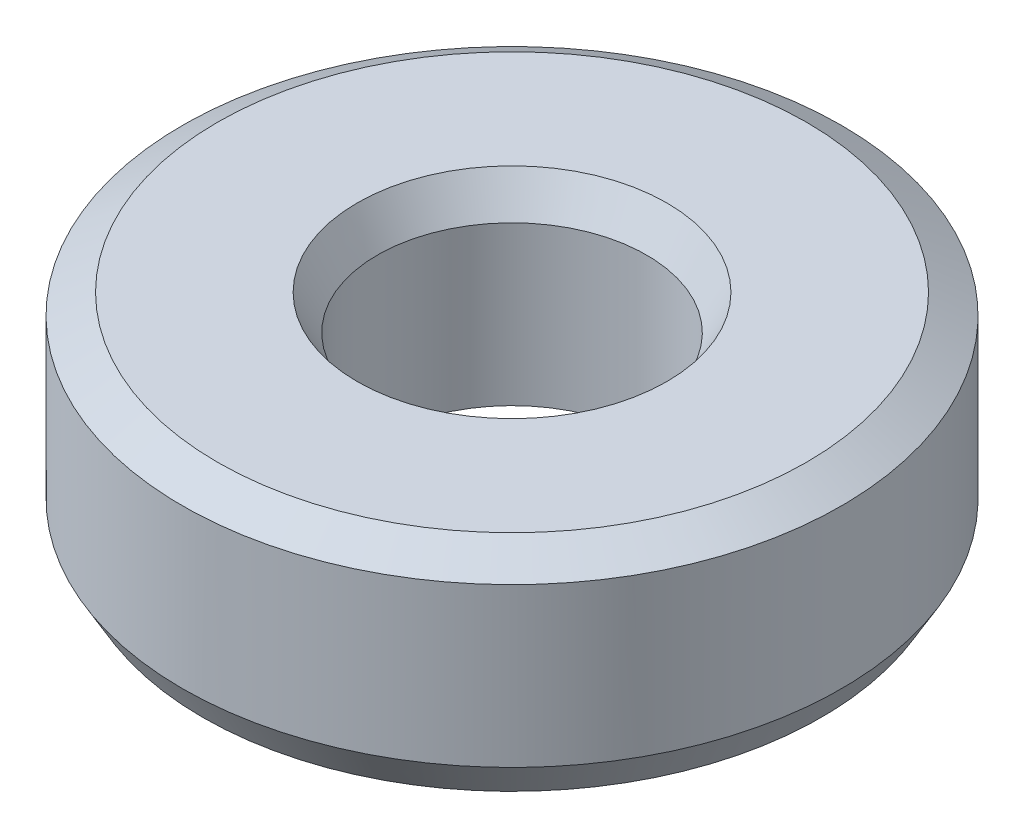
ISO-10303-21;
HEADER;
FILE_DESCRIPTION(('STEP AP214'),'2;1');
FILE_NAME('part.step','',(''),(''),'','','');
FILE_SCHEMA(('AUTOMOTIVE_DESIGN { 1 0 10303 214 1 1 1 1 }'));
ENDSEC;
DATA;
#1=APPLICATION_CONTEXT('core data for automotive mechanical design processes');
#2=APPLICATION_PROTOCOL_DEFINITION('international standard','automotive_design',2000,#1);
#3=PRODUCT_CONTEXT('',#1,'mechanical');
#4=PRODUCT('Part','Part','',(#3));
#5=PRODUCT_RELATED_PRODUCT_CATEGORY('part','',(#4));
#6=PRODUCT_DEFINITION_FORMATION('','',#4);
#7=PRODUCT_DEFINITION_CONTEXT('part definition',#1,'design');
#8=PRODUCT_DEFINITION('design','',#6,#7);
#9=PRODUCT_DEFINITION_SHAPE('','',#8);
#10=(LENGTH_UNIT() NAMED_UNIT(*) SI_UNIT(.MILLI.,.METRE.));
#11=(NAMED_UNIT(*) PLANE_ANGLE_UNIT() SI_UNIT($,.RADIAN.));
#12=(NAMED_UNIT(*) SI_UNIT($,.STERADIAN.) SOLID_ANGLE_UNIT());
#13=UNCERTAINTY_MEASURE_WITH_UNIT(LENGTH_MEASURE(1.E-05),#10,'distance_accuracy_value','');
#14=(GEOMETRIC_REPRESENTATION_CONTEXT(3) GLOBAL_UNCERTAINTY_ASSIGNED_CONTEXT((#13)) GLOBAL_UNIT_ASSIGNED_CONTEXT((#10,
#11,#12)) REPRESENTATION_CONTEXT('',''));
#15=CARTESIAN_POINT('',(0.,0.,0.));
#16=DIRECTION('',(0.,0.,1.));
#17=DIRECTION('',(1.,0.,0.));
#18=AXIS2_PLACEMENT_3D('',#15,#16,#17);
#19=CARTESIAN_POINT('',(0.,34.0249596878423,0.));
#20=DIRECTION('',(0.,-1.,0.));
#21=DIRECTION('',(0.,0.,-1.));
#22=AXIS2_PLACEMENT_3D('',#19,#20,#21);
#23=CYLINDRICAL_SURFACE('',#22,52.5);
#24=CARTESIAN_POINT('',(0.,5.57996706989229,0.));
#25=DIRECTION('',(0.,1.,0.));
#26=DIRECTION('',(0.,0.,1.));
#27=AXIS2_PLACEMENT_3D('',#24,#25,#26);
#28=CIRCLE('',#27,52.5);
#29=CARTESIAN_POINT('',(0.,5.57996706989229,52.5));
#30=VERTEX_POINT('',#29);
#31=EDGE_CURVE('E10',#30,#30,#28,.T.);
#32=ORIENTED_EDGE('',*,*,#31,.T.);
#33=EDGE_LOOP('',(#32));
#34=FACE_BOUND('',#33,.T.);
#35=CARTESIAN_POINT('',(0.,30.8033641979707,0.));
#36=DIRECTION('',(0.,1.,0.));
#37=DIRECTION('',(0.,0.,1.));
#38=AXIS2_PLACEMENT_3D('',#35,#36,#37);
#39=CIRCLE('',#38,52.5);
#40=CARTESIAN_POINT('',(0.,30.8033641979707,-52.5));
#41=VERTEX_POINT('',#40);
#42=EDGE_CURVE('E50',#41,#41,#39,.F.);
#43=ORIENTED_EDGE('',*,*,#42,.T.);
#44=EDGE_LOOP('',(#43));
#45=FACE_BOUND('',#44,.T.);
#46=ADVANCED_FACE('F39',(#34,#45),#23,.T.);
#47=CARTESIAN_POINT('',(0.,34.0249596878423,0.));
#48=DIRECTION('',(0.,1.,0.));
#49=DIRECTION('',(0.,0.,1.));
#50=AXIS2_PLACEMENT_3D('',#47,#48,#49);
#51=PLANE('',#50);
#52=CARTESIAN_POINT('',(0.,34.0249596878423,0.));
#53=DIRECTION('',(0.,1.,0.));
#54=DIRECTION('',(0.,0.,1.));
#55=AXIS2_PLACEMENT_3D('',#52,#53,#54);
#56=CIRCLE('',#55,24.6639551843926);
#57=CARTESIAN_POINT('',(0.,34.0249596878423,24.6639551843926));
#58=VERTEX_POINT('',#57);
#59=EDGE_CURVE('E58',#58,#58,#56,.F.);
#60=ORIENTED_EDGE('',*,*,#59,.T.);
#61=EDGE_LOOP('',(#60));
#62=FACE_BOUND('',#61,.T.);
#63=CARTESIAN_POINT('',(0.,34.0249596878423,0.));
#64=DIRECTION('',(0.,1.,0.));
#65=DIRECTION('',(0.,0.,1.));
#66=AXIS2_PLACEMENT_3D('',#63,#64,#65);
#67=CIRCLE('',#66,46.9200329301077);
#68=CARTESIAN_POINT('',(0.,34.0249596878423,-46.9200329301077));
#69=VERTEX_POINT('',#68);
#70=EDGE_CURVE('E61',#69,#69,#67,.T.);
#71=ORIENTED_EDGE('',*,*,#70,.T.);
#72=EDGE_LOOP('',(#71));
#73=FACE_BOUND('',#72,.T.);
#74=ADVANCED_FACE('F88',(#62,#73),#51,.T.);
#75=CARTESIAN_POINT('',(0.,0.,0.));
#76=DIRECTION('',(0.,1.,0.));
#77=DIRECTION('',(0.,0.,1.));
#78=AXIS2_PLACEMENT_3D('',#75,#76,#77);
#79=PLANE('',#78);
#80=CARTESIAN_POINT('',(0.,0.,0.));
#81=DIRECTION('',(0.,1.,0.));
#82=DIRECTION('',(0.,0.,1.));
#83=AXIS2_PLACEMENT_3D('',#80,#81,#82);
#84=CIRCLE('',#83,27.0223267644133);
#85=CARTESIAN_POINT('',(0.,0.,27.0223267644133));
#86=VERTEX_POINT('',#85);
#87=EDGE_CURVE('E51',#86,#86,#84,.T.);
#88=ORIENTED_EDGE('',*,*,#87,.T.);
#89=EDGE_LOOP('',(#88));
#90=FACE_BOUND('',#89,.T.);
#91=CARTESIAN_POINT('',(0.,0.,0.));
#92=DIRECTION('',(0.,1.,0.));
#93=DIRECTION('',(0.,0.,1.));
#94=AXIS2_PLACEMENT_3D('',#91,#92,#93);
#95=CIRCLE('',#94,49.2784045101284);
#96=CARTESIAN_POINT('',(0.,0.,49.2784045101284));
#97=VERTEX_POINT('',#96);
#98=EDGE_CURVE('E54',#97,#97,#95,.F.);
#99=ORIENTED_EDGE('',*,*,#98,.T.);
#100=EDGE_LOOP('',(#99));
#101=FACE_BOUND('',#100,.T.);
#102=ADVANCED_FACE('F83',(#90,#101),#79,.F.);
#103=CARTESIAN_POINT('',(0.,34.0249596878423,0.));
#104=DIRECTION('',(0.,-1.,0.));
#105=DIRECTION('',(0.,0.,-1.));
#106=AXIS2_PLACEMENT_3D('',#103,#104,#105);
#107=CYLINDRICAL_SURFACE('',#106,21.442359694521);
#108=CARTESIAN_POINT('',(0.,28.44499261795,0.));
#109=DIRECTION('',(0.,1.,0.));
#110=DIRECTION('',(0.,0.,1.));
#111=AXIS2_PLACEMENT_3D('',#108,#109,#110);
#112=CIRCLE('',#111,21.442359694521);
#113=CARTESIAN_POINT('',(0.,28.44499261795,21.442359694521));
#114=VERTEX_POINT('',#113);
#115=EDGE_CURVE('E67',#114,#114,#112,.T.);
#116=ORIENTED_EDGE('',*,*,#115,.T.);
#117=EDGE_LOOP('',(#116));
#118=FACE_BOUND('',#117,.T.);
#119=CARTESIAN_POINT('',(0.,3.22159548987157,0.));
#120=DIRECTION('',(0.,1.,0.));
#121=DIRECTION('',(0.,0.,1.));
#122=AXIS2_PLACEMENT_3D('',#119,#120,#121);
#123=CIRCLE('',#122,21.442359694521);
#124=CARTESIAN_POINT('',(0.,3.22159548987157,21.442359694521));
#125=VERTEX_POINT('',#124);
#126=EDGE_CURVE('E69',#125,#125,#123,.F.);
#127=ORIENTED_EDGE('',*,*,#126,.T.);
#128=EDGE_LOOP('',(#127));
#129=FACE_BOUND('',#128,.T.);
#130=ADVANCED_FACE('F71',(#118,#129),#107,.F.);
#131=CARTESIAN_POINT('',(0.,28.44499261795,0.));
#132=DIRECTION('',(0.,1.,0.));
#133=DIRECTION('',(0.,0.,1.));
#134=AXIS2_PLACEMENT_3D('',#131,#132,#133);
#135=CONICAL_SURFACE('',#134,21.442359694521,0.523598775598301);
#136=ORIENTED_EDGE('',*,*,#59,.F.);
#137=EDGE_LOOP('',(#136));
#138=FACE_BOUND('',#137,.T.);
#139=ORIENTED_EDGE('',*,*,#115,.F.);
#140=EDGE_LOOP('',(#139));
#141=FACE_BOUND('',#140,.T.);
#142=ADVANCED_FACE('F77',(#138,#141),#135,.F.);
#143=CARTESIAN_POINT('',(0.,0.,0.));
#144=DIRECTION('',(0.,-1.,0.));
#145=DIRECTION('',(0.,0.,-1.));
#146=AXIS2_PLACEMENT_3D('',#143,#144,#145);
#147=CONICAL_SURFACE('',#146,27.0223267644133,1.0471975511966);
#148=ORIENTED_EDGE('',*,*,#126,.F.);
#149=EDGE_LOOP('',(#148));
#150=FACE_BOUND('',#149,.T.);
#151=ORIENTED_EDGE('',*,*,#87,.F.);
#152=EDGE_LOOP('',(#151));
#153=FACE_BOUND('',#152,.T.);
#154=ADVANCED_FACE('F73',(#150,#153),#147,.F.);
#155=CARTESIAN_POINT('',(0.,5.57996706989229,0.));
#156=DIRECTION('',(0.,1.,0.));
#157=DIRECTION('',(0.,0.,1.));
#158=AXIS2_PLACEMENT_3D('',#155,#156,#157);
#159=CONICAL_SURFACE('',#158,52.5,0.523598775598302);
#160=ORIENTED_EDGE('',*,*,#98,.F.);
#161=EDGE_LOOP('',(#160));
#162=FACE_BOUND('',#161,.T.);
#163=ORIENTED_EDGE('',*,*,#31,.F.);
#164=EDGE_LOOP('',(#163));
#165=FACE_BOUND('',#164,.T.);
#166=ADVANCED_FACE('F76',(#162,#165),#159,.T.);
#167=CARTESIAN_POINT('',(0.,34.0249596878423,0.));
#168=DIRECTION('',(0.,-1.,0.));
#169=DIRECTION('',(0.,0.,-1.));
#170=AXIS2_PLACEMENT_3D('',#167,#168,#169);
#171=CONICAL_SURFACE('',#170,46.9200329301077,1.0471975511966);
#172=CARTESIAN_POINT('',(0.,30.8033641979707,-52.5));
#173=CARTESIAN_POINT('',(0.,30.8369224843236,-52.441875343022));
#174=CARTESIAN_POINT('',(0.,30.8704807706764,-52.3837506860439));
#175=CARTESIAN_POINT('',(0.,30.9375973433821,-52.2675013720878));
#176=CARTESIAN_POINT('',(0.,30.9711556297349,-52.2093767151098));
#177=CARTESIAN_POINT('',(0.,31.0382722024405,-52.0931274011537));
#178=CARTESIAN_POINT('',(0.,31.0718304887934,-52.0350027441756));
#179=CARTESIAN_POINT('',(0.,31.138947061499,-51.9187534302196));
#180=CARTESIAN_POINT('',(0.,31.1725053478519,-51.8606287732415));
#181=CARTESIAN_POINT('',(0.,31.2396219205575,-51.7443794592854));
#182=CARTESIAN_POINT('',(0.,31.2731802069103,-51.6862548023074));
#183=CARTESIAN_POINT('',(0.,31.340296779616,-51.5700054883513));
#184=CARTESIAN_POINT('',(0.,31.3738550659688,-51.5118808313732));
#185=CARTESIAN_POINT('',(0.,31.4409716386745,-51.3956315174172));
#186=CARTESIAN_POINT('',(0.,31.4745299250273,-51.3375068604391));
#187=CARTESIAN_POINT('',(0.,31.541646497733,-51.221257546483));
#188=CARTESIAN_POINT('',(0.,31.5752047840858,-51.163132889505));
#189=CARTESIAN_POINT('',(0.,31.6423213567915,-51.0468835755489));
#190=CARTESIAN_POINT('',(0.,31.6758796431443,-50.9887589185708));
#191=CARTESIAN_POINT('',(0.,31.7429962158499,-50.8725096046147));
#192=CARTESIAN_POINT('',(0.,31.7765545022028,-50.8143849476367));
#193=CARTESIAN_POINT('',(0.,31.8436710749084,-50.6981356336806));
#194=CARTESIAN_POINT('',(0.,31.8772293612613,-50.6400109767026));
#195=CARTESIAN_POINT('',(0.,31.9443459339669,-50.5237616627465));
#196=CARTESIAN_POINT('',(0.,31.9779042203198,-50.4656370057684));
#197=CARTESIAN_POINT('',(0.,32.0450207930254,-50.3493876918124));
#198=CARTESIAN_POINT('',(0.,32.0785790793782,-50.2912630348343));
#199=CARTESIAN_POINT('',(0.,32.1456956520839,-50.1750137208782));
#200=CARTESIAN_POINT('',(0.,32.1792539384367,-50.1168890639002));
#201=CARTESIAN_POINT('',(0.,32.2463705111424,-50.0006397499441));
#202=CARTESIAN_POINT('',(0.,32.2799287974952,-49.942515092966));
#203=CARTESIAN_POINT('',(0.,32.3470453702009,-49.82626577901));
#204=CARTESIAN_POINT('',(0.,32.3806036565537,-49.7681411220319));
#205=CARTESIAN_POINT('',(0.,32.4477202292593,-49.6518918080758));
#206=CARTESIAN_POINT('',(0.,32.4812785156122,-49.5937671510978));
#207=CARTESIAN_POINT('',(0.,32.5483950883178,-49.4775178371417));
#208=CARTESIAN_POINT('',(0.,32.5819533746707,-49.4193931801636));
#209=CARTESIAN_POINT('',(0.,32.6490699473763,-49.3031438662075));
#210=CARTESIAN_POINT('',(0.,32.6826282337292,-49.2450192092295));
#211=CARTESIAN_POINT('',(0.,32.7497448064348,-49.1287698952734));
#212=CARTESIAN_POINT('',(0.,32.7833030927876,-49.0706452382954));
#213=CARTESIAN_POINT('',(0.,32.8504196654933,-48.9543959243393));
#214=CARTESIAN_POINT('',(0.,32.8839779518461,-48.8962712673612));
#215=CARTESIAN_POINT('',(0.,32.9510945245518,-48.7800219534051));
#216=CARTESIAN_POINT('',(0.,32.9846528109046,-48.7218972964271));
#217=CARTESIAN_POINT('',(0.,33.0517693836103,-48.605647982471));
#218=CARTESIAN_POINT('',(0.,33.0853276699631,-48.547523325493));
#219=CARTESIAN_POINT('',(0.,33.1524442426688,-48.4312740115369));
#220=CARTESIAN_POINT('',(0.,33.1860025290216,-48.3731493545588));
#221=CARTESIAN_POINT('',(0.,33.2531191017272,-48.2569000406027));
#222=CARTESIAN_POINT('',(0.,33.2866773880801,-48.1987753836247));
#223=CARTESIAN_POINT('',(0.,33.3537939607857,-48.0825260696686));
#224=CARTESIAN_POINT('',(0.,33.3873522471386,-48.0244014126906));
#225=CARTESIAN_POINT('',(0.,33.4544688198442,-47.9081520987345));
#226=CARTESIAN_POINT('',(0.,33.488027106197,-47.8500274417564));
#227=CARTESIAN_POINT('',(0.,33.5551436789027,-47.7337781278003));
#228=CARTESIAN_POINT('',(0.,33.5887019652555,-47.6756534708223));
#229=CARTESIAN_POINT('',(0.,33.6558185379612,-47.5594041568662));
#230=CARTESIAN_POINT('',(0.,33.689376824314,-47.5012794998882));
#231=CARTESIAN_POINT('',(0.,33.7564933970197,-47.3850301859321));
#232=CARTESIAN_POINT('',(0.,33.7900516833725,-47.326905528954));
#233=CARTESIAN_POINT('',(0.,33.8571682560782,-47.2106562149979));
#234=CARTESIAN_POINT('',(0.,33.890726542431,-47.1525315580199));
#235=CARTESIAN_POINT('',(0.,33.9578431151366,-47.0362822440638));
#236=CARTESIAN_POINT('',(0.,33.9914014014895,-46.9781575870858));
#237=CARTESIAN_POINT('',(0.,34.0249596878423,-46.9200329301077));
#238=B_SPLINE_CURVE_WITH_KNOTS('',3,(#172,#173,#174,#175,#176,#177,#178,#179,#180,#181,#182,
#183,#184,#185,#186,#187,#188,#189,#190,#191,#192,#193,#194,#195,#196,#197,#198,#199,#200,#201,
#202,#203,#204,#205,#206,#207,#208,#209,#210,#211,#212,#213,#214,#215,#216,#217,#218,#219,#220,
#221,#222,#223,#224,#225,#226,#227,#228,#229,#230,#231,#232,#233,#234,#235,#236,#237),
.UNSPECIFIED.,.F.,.F.,(4,2,2,2,2,2,2,2,2,2,2,2,2,2,2,2,2,2,2,2,2,2,2,2,2,2,2,2,2,2,2,2,4),(0.,
0.201349718116969,0.402699436233944,0.604049154350913,0.805398872467888,1.00674859058486,
1.20809830870183,1.4094480268188,1.61079774493578,1.81214746305275,2.01349718116972,
2.21484689928669,2.41619661740367,2.61754633552064,2.81889605363761,3.02024577175458,
3.22159548987156,3.42294520798852,3.6242949261055,3.82564464422247,4.02699436233944,
4.22834408045641,4.42969379857339,4.63104351669036,4.83239323480733,5.03374295292431,
5.23509267104128,5.43644238915825,5.63779210727522,5.8391418253922,6.04049154350917,
6.24184126162614,6.44319097974311),.UNSPECIFIED.);
#239=EDGE_CURVE('BSEAM45',#41,#69,#238,.T.);
#240=ORIENTED_EDGE('',*,*,#42,.F.);
#241=ORIENTED_EDGE('',*,*,#70,.F.);
#242=ORIENTED_EDGE('',*,*,#239,.T.);
#243=ORIENTED_EDGE('',*,*,#239,.F.);
#244=EDGE_LOOP('',(#240,#242,#241,#243));
#245=FACE_BOUND('',#244,.T.);
#246=ADVANCED_FACE('F45',(#245),#171,.T.);
#247=CLOSED_SHELL('',(#46,#74,#102,#130,#142,#154,#166,#246));
#248=MANIFOLD_SOLID_BREP('B2',#247);
#249=ADVANCED_BREP_SHAPE_REPRESENTATION('',(#18,#248),#14);
#250=SHAPE_DEFINITION_REPRESENTATION(#9,#249);
ENDSEC;
END-ISO-10303-21;
